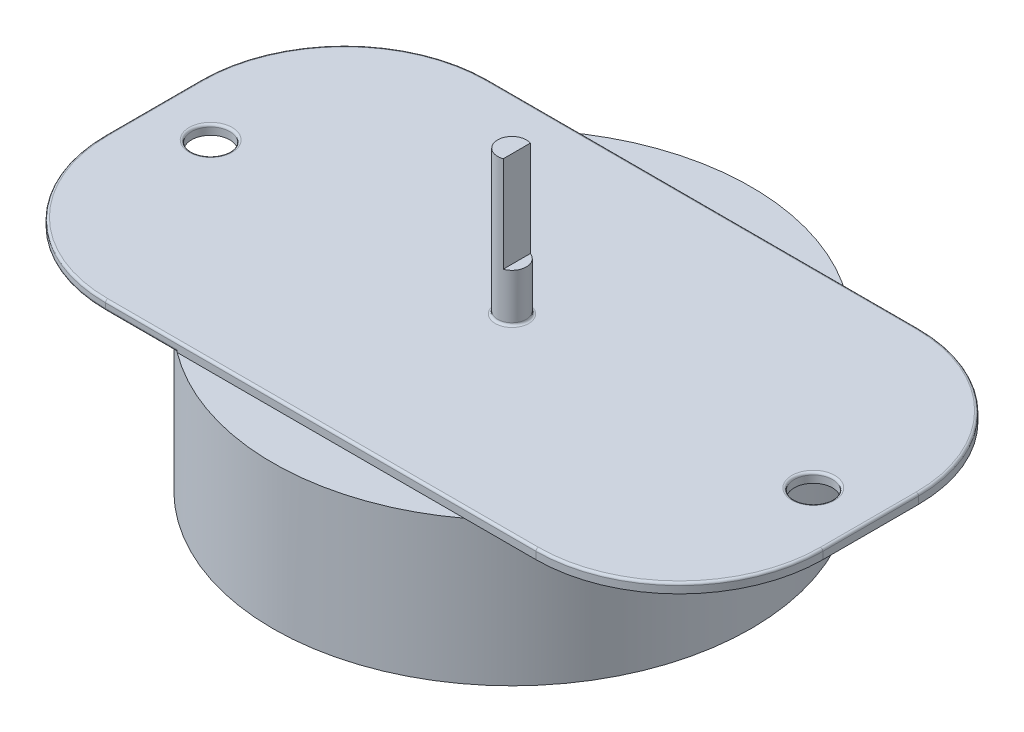
ISO-10303-21;
HEADER;
FILE_DESCRIPTION(('STEP AP214'),'2;1');
FILE_NAME('part.step','',(''),(''),'','','');
FILE_SCHEMA(('AUTOMOTIVE_DESIGN { 1 0 10303 214 1 1 1 1 }'));
ENDSEC;
DATA;
#1=APPLICATION_CONTEXT('core data for automotive mechanical design processes');
#2=APPLICATION_PROTOCOL_DEFINITION('international standard','automotive_design',2000,#1);
#3=PRODUCT_CONTEXT('',#1,'mechanical');
#4=PRODUCT('Part','Part','',(#3));
#5=PRODUCT_RELATED_PRODUCT_CATEGORY('part','',(#4));
#6=PRODUCT_DEFINITION_FORMATION('','',#4);
#7=PRODUCT_DEFINITION_CONTEXT('part definition',#1,'design');
#8=PRODUCT_DEFINITION('design','',#6,#7);
#9=PRODUCT_DEFINITION_SHAPE('','',#8);
#10=(LENGTH_UNIT() NAMED_UNIT(*) SI_UNIT(.MILLI.,.METRE.));
#11=(NAMED_UNIT(*) PLANE_ANGLE_UNIT() SI_UNIT($,.RADIAN.));
#12=(NAMED_UNIT(*) SI_UNIT($,.STERADIAN.) SOLID_ANGLE_UNIT());
#13=UNCERTAINTY_MEASURE_WITH_UNIT(LENGTH_MEASURE(1.E-05),#10,'distance_accuracy_value','');
#14=(GEOMETRIC_REPRESENTATION_CONTEXT(3) GLOBAL_UNCERTAINTY_ASSIGNED_CONTEXT((#13)) GLOBAL_UNIT_ASSIGNED_CONTEXT((#10,
#11,#12)) REPRESENTATION_CONTEXT('',''));
#15=CARTESIAN_POINT('',(0.,0.,0.));
#16=DIRECTION('',(0.,0.,1.));
#17=DIRECTION('',(1.,0.,0.));
#18=AXIS2_PLACEMENT_3D('',#15,#16,#17);
#19=CARTESIAN_POINT('',(0.,30.,0.));
#20=DIRECTION('',(0.,1.,0.));
#21=DIRECTION('',(0.,0.,1.));
#22=AXIS2_PLACEMENT_3D('',#19,#20,#21);
#23=PLANE('',#22);
#24=DIRECTION('',(1.,0.,0.));
#25=VECTOR('',#24,1.);
#26=CARTESIAN_POINT('',(-44.9999999999998,30.,40.));
#27=LINE('',#26,#25);
#28=CARTESIAN_POINT('',(-30.,30.,40.));
#29=VERTEX_POINT('',#28);
#30=CARTESIAN_POINT('',(30.,30.,40.));
#31=VERTEX_POINT('',#30);
#32=EDGE_CURVE('E185',#29,#31,#27,.T.);
#33=ORIENTED_EDGE('',*,*,#32,.F.);
#34=CARTESIAN_POINT('',(0.,30.,0.));
#35=DIRECTION('',(0.,1.,0.));
#36=DIRECTION('',(0.,0.,1.));
#37=AXIS2_PLACEMENT_3D('',#34,#35,#36);
#38=CIRCLE('',#37,50.);
#39=EDGE_CURVE('E240',#29,#31,#38,.T.);
#40=ORIENTED_EDGE('',*,*,#39,.T.);
#41=EDGE_LOOP('',(#33,#40));
#42=FACE_BOUND('',#41,.T.);
#43=ADVANCED_FACE('F33',(#42),#23,.T.);
#44=CARTESIAN_POINT('',(0.,30.,0.));
#45=DIRECTION('',(0.,-1.,0.));
#46=DIRECTION('',(0.,0.,-1.));
#47=AXIS2_PLACEMENT_3D('',#44,#45,#46);
#48=CYLINDRICAL_SURFACE('',#47,50.);
#49=CARTESIAN_POINT('',(30.,30.,-40.));
#50=VERTEX_POINT('',#49);
#51=EDGE_CURVE('E234',#31,#50,#38,.T.);
#52=ORIENTED_EDGE('',*,*,#51,.F.);
#53=ORIENTED_EDGE('',*,*,#39,.F.);
#54=DIRECTION('',(0.,-1.,0.));
#55=VECTOR('',#54,1.);
#56=CARTESIAN_POINT('',(-30.,30.5,40.));
#57=LINE('',#56,#55);
#58=CARTESIAN_POINT('',(-30.,30.5,40.));
#59=VERTEX_POINT('',#58);
#60=EDGE_CURVE('E261',#59,#29,#57,.T.);
#61=ORIENTED_EDGE('',*,*,#60,.F.);
#62=CARTESIAN_POINT('',(-30.,30.5,40.));
#63=CARTESIAN_POINT('',(-29.9999469297059,30.4793692661863,40.0000392803304));
#64=CARTESIAN_POINT('',(-30.0016989201943,30.4588235687539,39.998725841537));
#65=CARTESIAN_POINT('',(-30.0083241019986,30.4187823807294,39.9937559096194));
#66=CARTESIAN_POINT('',(-30.0131589564491,30.3992771360781,39.9901281953354));
#67=CARTESIAN_POINT('',(-30.0254527079931,30.361751862697,39.9808984921336));
#68=CARTESIAN_POINT('',(-30.0328991094319,30.3437252570946,39.9753059044628));
#69=CARTESIAN_POINT('',(-30.0498772600628,30.3092358992607,39.9625448532448));
#70=CARTESIAN_POINT('',(-30.0594157994969,30.2927784955314,39.9553712580058));
#71=CARTESIAN_POINT('',(-30.0858225670734,30.2528492800216,39.9354939882128));
#72=CARTESIAN_POINT('',(-30.1038199785172,30.2305561299036,39.9219312780019));
#73=CARTESIAN_POINT('',(-30.1423057120615,30.1897196783676,39.8928815032563));
#74=CARTESIAN_POINT('',(-30.1627993557367,30.1711846207662,39.8773903259289));
#75=CARTESIAN_POINT('',(-30.2181178759483,30.127401561739,39.8355012064913));
#76=CARTESIAN_POINT('',(-30.254211491877,30.1047259337677,39.8081003104529));
#77=CARTESIAN_POINT('',(-30.3286471596581,30.0664572811339,39.7514197845569));
#78=CARTESIAN_POINT('',(-30.3669961728558,30.0508876407468,39.7221343085376));
#79=CARTESIAN_POINT('',(-30.4469457929851,30.0253723675798,39.660889499431));
#80=CARTESIAN_POINT('',(-30.4886106855827,30.015771410768,39.6288708889413));
#81=CARTESIAN_POINT('',(-30.5512438270458,30.0062671609228,39.5805784559912));
#82=CARTESIAN_POINT('',(-30.5720414537973,30.0039150320054,39.5645166080688));
#83=CARTESIAN_POINT('',(-30.6136756573131,30.000783728554,39.5323102663351));
#84=CARTESIAN_POINT('',(-30.6345122111527,30.0000038146101,39.5161658149555));
#85=CARTESIAN_POINT('',(-30.6553421119387,30.,39.5));
#86=B_SPLINE_CURVE_WITH_KNOTS('',3,(#62,#63,#64,#65,#66,#67,#68,#69,#70,#71,#72,#73,#74,#75,#76,
#77,#78,#79,#80,#81,#82,#83,#84,#85),.UNSPECIFIED.,.F.,.F.,(4,2,2,2,2,2,2,2,2,2,2,4),(0.,
0.0616416621265255,0.122531345672272,0.183133573789917,0.243935482288643,0.338495231506317,
0.433260216403084,0.584439392134947,0.736112541044804,0.89588412437172,0.974994689240367,
1.05406803985992),.UNSPECIFIED.);
#87=CARTESIAN_POINT('',(-30.6553421119387,30.,39.5));
#88=VERTEX_POINT('',#87);
#89=EDGE_CURVE('E11',#59,#88,#86,.T.);
#90=ORIENTED_EDGE('',*,*,#89,.T.);
#91=CARTESIAN_POINT('',(-30.6553421119387,30.,-39.5));
#92=VERTEX_POINT('',#91);
#93=EDGE_CURVE('E238',#92,#88,#38,.T.);
#94=ORIENTED_EDGE('',*,*,#93,.F.);
#95=CARTESIAN_POINT('',(-30.6553421119387,30.,-39.5));
#96=CARTESIAN_POINT('',(-30.6266004798523,30.0000150610145,-39.5223064522361));
#97=CARTESIAN_POINT('',(-30.5978279966109,30.0014937558282,-39.5445855688725));
#98=CARTESIAN_POINT('',(-30.5403569153179,30.0074672286459,-39.5889872408276));
#99=CARTESIAN_POINT('',(-30.5116587058671,30.0119698653224,-39.6111092360467));
#100=CARTESIAN_POINT('',(-30.4542933600515,30.0241510211872,-39.6552309653688));
#101=CARTESIAN_POINT('',(-30.4256304401244,30.0318657498664,-39.6772263096515));
#102=CARTESIAN_POINT('',(-30.3689936390467,30.0506703880144,-39.7205928233665));
#103=CARTESIAN_POINT('',(-30.3410189228909,30.0617559646291,-39.7419647557025));
#104=CARTESIAN_POINT('',(-30.285861090409,30.0877467705342,-39.7840147726815));
#105=CARTESIAN_POINT('',(-30.2586876400879,30.1026862452527,-39.8046846521015));
#106=CARTESIAN_POINT('',(-30.2060754983435,30.1367890212168,-39.8446243131571));
#107=CARTESIAN_POINT('',(-30.1806324735777,30.1559412215375,-39.8638976007227));
#108=CARTESIAN_POINT('',(-30.137915379747,30.1942157323847,-39.8961978737262));
#109=CARTESIAN_POINT('',(-30.1200963851233,30.21236211134,-39.9096508402874));
#110=CARTESIAN_POINT('',(-30.0868519819524,30.251876876341,-39.9347188318157));
#111=CARTESIAN_POINT('',(-30.071423071285,30.2732404559666,-39.946336546427));
#112=CARTESIAN_POINT('',(-30.0481915625417,30.3124102603364,-39.9638127498717));
#113=CARTESIAN_POINT('',(-30.0394876720773,30.3293724303923,-39.9703548977456));
#114=CARTESIAN_POINT('',(-30.0243499643768,30.3647845264933,-39.9817270539512));
#115=CARTESIAN_POINT('',(-30.0179091639889,30.3832296562302,-39.9865623293489));
#116=CARTESIAN_POINT('',(-30.0086961045509,30.417934759082,-39.9934768074905));
#117=CARTESIAN_POINT('',(-30.0054777473321,30.434008132035,-39.995891260257));
#118=CARTESIAN_POINT('',(-30.0011095292461,30.4667072289504,-39.9991678584675));
#119=CARTESIAN_POINT('',(-29.999975326724,30.4833361860595,-40.0000182531173));
#120=CARTESIAN_POINT('',(-30.,30.5,-40.));
#121=B_SPLINE_CURVE_WITH_KNOTS('',3,(#95,#96,#97,#98,#99,#100,#101,#102,#103,#104,#105,#106,
#107,#108,#109,#110,#111,#112,#113,#114,#115,#116,#117,#118,#119,#120),.UNSPECIFIED.,.F.,.F.,(4,
2,2,2,2,2,2,2,2,2,2,2,4),(0.,0.109129044511871,0.218542798601844,0.329224866250502,
0.439765261405262,0.551323940009137,0.662592099617478,0.748656082517678,0.834592740594066,
0.894855060503514,0.954929763112282,1.00443366998699,1.05430800463638),.UNSPECIFIED.);
#122=CARTESIAN_POINT('',(-30.,30.5,-40.));
#123=VERTEX_POINT('',#122);
#124=EDGE_CURVE('E42',#92,#123,#121,.T.);
#125=ORIENTED_EDGE('',*,*,#124,.T.);
#126=DIRECTION('',(0.,-1.,0.));
#127=VECTOR('',#126,1.);
#128=CARTESIAN_POINT('',(-30.,30.,-40.));
#129=LINE('',#128,#127);
#130=CARTESIAN_POINT('',(-30.,30.,-40.));
#131=VERTEX_POINT('',#130);
#132=EDGE_CURVE('E50',#131,#123,#129,.F.);
#133=ORIENTED_EDGE('',*,*,#132,.F.);
#134=EDGE_CURVE('E237',#50,#131,#38,.T.);
#135=ORIENTED_EDGE('',*,*,#134,.F.);
#136=EDGE_LOOP('',(#52,#53,#61,#90,#94,#125,#133,#135));
#137=FACE_BOUND('',#136,.T.);
#138=CARTESIAN_POINT('',(0.,0.,0.));
#139=DIRECTION('',(0.,1.,0.));
#140=DIRECTION('',(0.,0.,1.));
#141=AXIS2_PLACEMENT_3D('',#138,#139,#140);
#142=CIRCLE('',#141,50.);
#143=CARTESIAN_POINT('',(0.,0.,50.));
#144=VERTEX_POINT('',#143);
#145=EDGE_CURVE('E233',#144,#144,#142,.T.);
#146=ORIENTED_EDGE('',*,*,#145,.T.);
#147=EDGE_LOOP('',(#146));
#148=FACE_BOUND('',#147,.T.);
#149=ADVANCED_FACE('F332',(#137,#148),#48,.T.);
#150=DIRECTION('',(-1.,0.,0.));
#151=VECTOR('',#150,1.);
#152=CARTESIAN_POINT('',(-44.9999999999998,30.,-40.));
#153=LINE('',#152,#151);
#154=EDGE_CURVE('E204',#50,#131,#153,.T.);
#155=ORIENTED_EDGE('',*,*,#154,.F.);
#156=ORIENTED_EDGE('',*,*,#134,.T.);
#157=EDGE_LOOP('',(#155,#156));
#158=FACE_BOUND('',#157,.T.);
#159=ADVANCED_FACE('F403',(#158),#23,.T.);
#160=CARTESIAN_POINT('',(0.,0.,0.));
#161=DIRECTION('',(0.,1.,0.));
#162=DIRECTION('',(0.,0.,1.));
#163=AXIS2_PLACEMENT_3D('',#160,#161,#162);
#164=PLANE('',#163);
#165=ORIENTED_EDGE('',*,*,#145,.F.);
#166=EDGE_LOOP('',(#165));
#167=FACE_BOUND('',#166,.T.);
#168=ADVANCED_FACE('F410',(#167),#164,.F.);
#169=CARTESIAN_POINT('',(45.,30.,-10.));
#170=DIRECTION('',(0.,-1.,0.));
#171=DIRECTION('',(0.,0.,-1.));
#172=AXIS2_PLACEMENT_3D('',#169,#170,#171);
#173=PLANE('',#172);
#174=CARTESIAN_POINT('',(63.,30.,0.));
#175=DIRECTION('',(0.,-1.,0.));
#176=DIRECTION('',(0.,0.,-1.));
#177=AXIS2_PLACEMENT_3D('',#174,#175,#176);
#178=CIRCLE('',#177,4.00000000000001);
#179=CARTESIAN_POINT('',(63.,30.,-4.00000000000001));
#180=VERTEX_POINT('',#179);
#181=EDGE_CURVE('E481',#180,#180,#178,.F.);
#182=ORIENTED_EDGE('',*,*,#181,.T.);
#183=EDGE_LOOP('',(#182));
#184=FACE_BOUND('',#183,.T.);
#185=CARTESIAN_POINT('',(44.9999999999998,30.,40.));
#186=VERTEX_POINT('',#185);
#187=EDGE_CURVE('E203',#31,#186,#27,.T.);
#188=ORIENTED_EDGE('',*,*,#187,.F.);
#189=ORIENTED_EDGE('',*,*,#51,.T.);
#190=CARTESIAN_POINT('',(44.9999999999998,30.,-40.));
#191=VERTEX_POINT('',#190);
#192=EDGE_CURVE('E197',#191,#50,#153,.T.);
#193=ORIENTED_EDGE('',*,*,#192,.F.);
#194=CARTESIAN_POINT('',(45.,30.,-10.));
#195=DIRECTION('',(0.,1.,0.));
#196=DIRECTION('',(0.,0.,-1.));
#197=AXIS2_PLACEMENT_3D('',#194,#195,#196);
#198=CIRCLE('',#197,30.);
#199=CARTESIAN_POINT('',(75.,30.,-9.99999999999978));
#200=VERTEX_POINT('',#199);
#201=EDGE_CURVE('E194',#200,#191,#198,.T.);
#202=ORIENTED_EDGE('',*,*,#201,.F.);
#203=DIRECTION('',(0.,0.,-1.));
#204=VECTOR('',#203,1.);
#205=CARTESIAN_POINT('',(75.,30.,9.99999999999979));
#206=LINE('',#205,#204);
#207=CARTESIAN_POINT('',(75.,30.,9.99999999999979));
#208=VERTEX_POINT('',#207);
#209=EDGE_CURVE('E210',#208,#200,#206,.T.);
#210=ORIENTED_EDGE('',*,*,#209,.F.);
#211=CARTESIAN_POINT('',(45.,30.,10.));
#212=DIRECTION('',(0.,1.,0.));
#213=DIRECTION('',(0.,0.,1.));
#214=AXIS2_PLACEMENT_3D('',#211,#212,#213);
#215=CIRCLE('',#214,30.);
#216=EDGE_CURVE('E207',#186,#208,#215,.T.);
#217=ORIENTED_EDGE('',*,*,#216,.F.);
#218=EDGE_LOOP('',(#188,#189,#193,#202,#210,#217));
#219=FACE_BOUND('',#218,.T.);
#220=ADVANCED_FACE('F415',(#184,#219),#173,.T.);
#221=CARTESIAN_POINT('',(45.,32.,-10.));
#222=DIRECTION('',(0.,-1.,0.));
#223=DIRECTION('',(0.,0.,-1.));
#224=AXIS2_PLACEMENT_3D('',#221,#222,#223);
#225=CYLINDRICAL_SURFACE('',#224,30.);
#226=DIRECTION('',(0.,-1.,0.));
#227=VECTOR('',#226,1.);
#228=CARTESIAN_POINT('',(44.9999999999998,32.,-40.));
#229=LINE('',#228,#227);
#230=CARTESIAN_POINT('',(44.9999999999998,31.5,-40.));
#231=VERTEX_POINT('',#230);
#232=EDGE_CURVE('E231',#231,#191,#229,.T.);
#233=ORIENTED_EDGE('',*,*,#232,.F.);
#234=CARTESIAN_POINT('',(45.,31.5,-10.));
#235=DIRECTION('',(0.,-1.,0.));
#236=DIRECTION('',(0.,0.,-1.));
#237=AXIS2_PLACEMENT_3D('',#234,#235,#236);
#238=CIRCLE('',#237,30.);
#239=CARTESIAN_POINT('',(75.,31.5,-9.99999999999978));
#240=VERTEX_POINT('',#239);
#241=EDGE_CURVE('E309',#231,#240,#238,.T.);
#242=ORIENTED_EDGE('',*,*,#241,.T.);
#243=DIRECTION('',(0.,-1.,0.));
#244=VECTOR('',#243,1.);
#245=CARTESIAN_POINT('',(75.,32.,-9.99999999999978));
#246=LINE('',#245,#244);
#247=EDGE_CURVE('E213',#240,#200,#246,.T.);
#248=ORIENTED_EDGE('',*,*,#247,.T.);
#249=ORIENTED_EDGE('',*,*,#201,.T.);
#250=EDGE_LOOP('',(#233,#242,#248,#249));
#251=FACE_BOUND('',#250,.T.);
#252=ADVANCED_FACE('F434',(#251),#225,.T.);
#253=CARTESIAN_POINT('',(-44.9999999999998,32.,-40.));
#254=DIRECTION('',(0.,0.,1.));
#255=DIRECTION('',(1.,0.,0.));
#256=AXIS2_PLACEMENT_3D('',#253,#254,#255);
#257=PLANE('',#256);
#258=ORIENTED_EDGE('',*,*,#132,.T.);
#259=DIRECTION('',(-1.,0.,0.));
#260=VECTOR('',#259,1.);
#261=CARTESIAN_POINT('',(-44.9999999999998,30.5,-40.));
#262=LINE('',#261,#260);
#263=CARTESIAN_POINT('',(-44.9999999999998,30.5,-40.));
#264=VERTEX_POINT('',#263);
#265=EDGE_CURVE('E246',#123,#264,#262,.T.);
#266=ORIENTED_EDGE('',*,*,#265,.T.);
#267=DIRECTION('',(0.,-1.,0.));
#268=VECTOR('',#267,1.);
#269=CARTESIAN_POINT('',(-44.9999999999998,32.,-40.));
#270=LINE('',#269,#268);
#271=CARTESIAN_POINT('',(-44.9999999999998,31.5,-40.));
#272=VERTEX_POINT('',#271);
#273=EDGE_CURVE('E228',#272,#264,#270,.T.);
#274=ORIENTED_EDGE('',*,*,#273,.F.);
#275=DIRECTION('',(-1.,0.,0.));
#276=VECTOR('',#275,1.);
#277=CARTESIAN_POINT('',(-44.9999999999998,31.5,-40.));
#278=LINE('',#277,#276);
#279=EDGE_CURVE('E243',#272,#231,#278,.F.);
#280=ORIENTED_EDGE('',*,*,#279,.T.);
#281=ORIENTED_EDGE('',*,*,#232,.T.);
#282=ORIENTED_EDGE('',*,*,#192,.T.);
#283=ORIENTED_EDGE('',*,*,#154,.T.);
#284=EDGE_LOOP('',(#258,#266,#274,#280,#281,#282,#283));
#285=FACE_BOUND('',#284,.T.);
#286=ADVANCED_FACE('F428',(#285),#257,.F.);
#287=CARTESIAN_POINT('',(-45.,32.,-10.));
#288=DIRECTION('',(0.,-1.,0.));
#289=DIRECTION('',(0.,0.,-1.));
#290=AXIS2_PLACEMENT_3D('',#287,#288,#289);
#291=CYLINDRICAL_SURFACE('',#290,30.);
#292=DIRECTION('',(0.,-1.,0.));
#293=VECTOR('',#292,1.);
#294=CARTESIAN_POINT('',(-75.,32.,-9.99999999999978));
#295=LINE('',#294,#293);
#296=CARTESIAN_POINT('',(-75.,31.5,-9.99999999999978));
#297=VERTEX_POINT('',#296);
#298=CARTESIAN_POINT('',(-75.,30.5,-9.99999999999978));
#299=VERTEX_POINT('',#298);
#300=EDGE_CURVE('E225',#297,#299,#295,.T.);
#301=ORIENTED_EDGE('',*,*,#300,.F.);
#302=CARTESIAN_POINT('',(-45.,31.5,-10.));
#303=DIRECTION('',(0.,-1.,0.));
#304=DIRECTION('',(0.,0.,-1.));
#305=AXIS2_PLACEMENT_3D('',#302,#303,#304);
#306=CIRCLE('',#305,30.);
#307=EDGE_CURVE('E307',#297,#272,#306,.T.);
#308=ORIENTED_EDGE('',*,*,#307,.T.);
#309=ORIENTED_EDGE('',*,*,#273,.T.);
#310=CARTESIAN_POINT('',(-45.,30.5,-10.));
#311=DIRECTION('',(0.,-1.,0.));
#312=DIRECTION('',(0.,0.,-1.));
#313=AXIS2_PLACEMENT_3D('',#310,#311,#312);
#314=CIRCLE('',#313,30.);
#315=EDGE_CURVE('E305',#264,#299,#314,.F.);
#316=ORIENTED_EDGE('',*,*,#315,.T.);
#317=EDGE_LOOP('',(#301,#308,#309,#316));
#318=FACE_BOUND('',#317,.T.);
#319=ADVANCED_FACE('F537',(#318),#291,.T.);
#320=CARTESIAN_POINT('',(-75.,32.,9.99999999999979));
#321=DIRECTION('',(1.,0.,0.));
#322=DIRECTION('',(0.,0.,-1.));
#323=AXIS2_PLACEMENT_3D('',#320,#321,#322);
#324=PLANE('',#323);
#325=ORIENTED_EDGE('',*,*,#300,.T.);
#326=DIRECTION('',(0.,0.,1.));
#327=VECTOR('',#326,1.);
#328=CARTESIAN_POINT('',(-75.,30.5,9.99999999999979));
#329=LINE('',#328,#327);
#330=CARTESIAN_POINT('',(-75.,30.5,9.99999999999979));
#331=VERTEX_POINT('',#330);
#332=EDGE_CURVE('E272',#299,#331,#329,.T.);
#333=ORIENTED_EDGE('',*,*,#332,.T.);
#334=DIRECTION('',(0.,-1.,0.));
#335=VECTOR('',#334,1.);
#336=CARTESIAN_POINT('',(-75.,32.,9.99999999999979));
#337=LINE('',#336,#335);
#338=CARTESIAN_POINT('',(-75.,31.5,9.99999999999979));
#339=VERTEX_POINT('',#338);
#340=EDGE_CURVE('E222',#339,#331,#337,.T.);
#341=ORIENTED_EDGE('',*,*,#340,.F.);
#342=DIRECTION('',(0.,0.,1.));
#343=VECTOR('',#342,1.);
#344=CARTESIAN_POINT('',(-75.,31.5,9.99999999999979));
#345=LINE('',#344,#343);
#346=EDGE_CURVE('E270',#339,#297,#345,.F.);
#347=ORIENTED_EDGE('',*,*,#346,.T.);
#348=EDGE_LOOP('',(#325,#333,#341,#347));
#349=FACE_BOUND('',#348,.T.);
#350=ADVANCED_FACE('F533',(#349),#324,.F.);
#351=CARTESIAN_POINT('',(-45.,32.,10.));
#352=DIRECTION('',(0.,-1.,0.));
#353=DIRECTION('',(0.,0.,-1.));
#354=AXIS2_PLACEMENT_3D('',#351,#352,#353);
#355=CYLINDRICAL_SURFACE('',#354,30.);
#356=ORIENTED_EDGE('',*,*,#340,.T.);
#357=CARTESIAN_POINT('',(-45.,30.5,10.));
#358=DIRECTION('',(0.,-1.,0.));
#359=DIRECTION('',(0.,0.,-1.));
#360=AXIS2_PLACEMENT_3D('',#357,#358,#359);
#361=CIRCLE('',#360,30.);
#362=CARTESIAN_POINT('',(-44.9999999999998,30.5,40.));
#363=VERTEX_POINT('',#362);
#364=EDGE_CURVE('E268',#331,#363,#361,.F.);
#365=ORIENTED_EDGE('',*,*,#364,.T.);
#366=DIRECTION('',(0.,-1.,0.));
#367=VECTOR('',#366,1.);
#368=CARTESIAN_POINT('',(-44.9999999999998,32.,40.));
#369=LINE('',#368,#367);
#370=CARTESIAN_POINT('',(-44.9999999999998,31.5,40.));
#371=VERTEX_POINT('',#370);
#372=EDGE_CURVE('E219',#371,#363,#369,.T.);
#373=ORIENTED_EDGE('',*,*,#372,.F.);
#374=CARTESIAN_POINT('',(-45.,31.5,10.));
#375=DIRECTION('',(0.,-1.,0.));
#376=DIRECTION('',(0.,0.,-1.));
#377=AXIS2_PLACEMENT_3D('',#374,#375,#376);
#378=CIRCLE('',#377,30.);
#379=EDGE_CURVE('E266',#371,#339,#378,.T.);
#380=ORIENTED_EDGE('',*,*,#379,.T.);
#381=EDGE_LOOP('',(#356,#365,#373,#380));
#382=FACE_BOUND('',#381,.T.);
#383=ADVANCED_FACE('F529',(#382),#355,.T.);
#384=CARTESIAN_POINT('',(-44.9999999999998,32.,40.));
#385=DIRECTION('',(0.,0.,-1.));
#386=DIRECTION('',(-1.,0.,0.));
#387=AXIS2_PLACEMENT_3D('',#384,#385,#386);
#388=PLANE('',#387);
#389=ORIENTED_EDGE('',*,*,#372,.T.);
#390=DIRECTION('',(1.,0.,0.));
#391=VECTOR('',#390,1.);
#392=CARTESIAN_POINT('',(-30.,30.5,40.));
#393=LINE('',#392,#391);
#394=EDGE_CURVE('E263',#363,#59,#393,.T.);
#395=ORIENTED_EDGE('',*,*,#394,.T.);
#396=ORIENTED_EDGE('',*,*,#60,.T.);
#397=ORIENTED_EDGE('',*,*,#32,.T.);
#398=ORIENTED_EDGE('',*,*,#187,.T.);
#399=DIRECTION('',(0.,-1.,0.));
#400=VECTOR('',#399,1.);
#401=CARTESIAN_POINT('',(44.9999999999998,32.,40.));
#402=LINE('',#401,#400);
#403=CARTESIAN_POINT('',(44.9999999999998,31.5,40.));
#404=VERTEX_POINT('',#403);
#405=EDGE_CURVE('E217',#404,#186,#402,.T.);
#406=ORIENTED_EDGE('',*,*,#405,.F.);
#407=DIRECTION('',(1.,0.,0.));
#408=VECTOR('',#407,1.);
#409=CARTESIAN_POINT('',(-44.9999999999998,31.5,40.));
#410=LINE('',#409,#408);
#411=EDGE_CURVE('E259',#404,#371,#410,.F.);
#412=ORIENTED_EDGE('',*,*,#411,.T.);
#413=EDGE_LOOP('',(#389,#395,#396,#397,#398,#406,#412));
#414=FACE_BOUND('',#413,.T.);
#415=ADVANCED_FACE('F525',(#414),#388,.F.);
#416=CARTESIAN_POINT('',(45.,32.,10.));
#417=DIRECTION('',(0.,-1.,0.));
#418=DIRECTION('',(0.,0.,-1.));
#419=AXIS2_PLACEMENT_3D('',#416,#417,#418);
#420=CYLINDRICAL_SURFACE('',#419,30.);
#421=DIRECTION('',(0.,-1.,0.));
#422=VECTOR('',#421,1.);
#423=CARTESIAN_POINT('',(75.,32.,9.99999999999979));
#424=LINE('',#423,#422);
#425=CARTESIAN_POINT('',(75.,31.5,9.99999999999979));
#426=VERTEX_POINT('',#425);
#427=EDGE_CURVE('E215',#426,#208,#424,.T.);
#428=ORIENTED_EDGE('',*,*,#427,.F.);
#429=CARTESIAN_POINT('',(45.,31.5,10.));
#430=DIRECTION('',(0.,-1.,0.));
#431=DIRECTION('',(0.,0.,-1.));
#432=AXIS2_PLACEMENT_3D('',#429,#430,#431);
#433=CIRCLE('',#432,30.);
#434=EDGE_CURVE('E303',#426,#404,#433,.T.);
#435=ORIENTED_EDGE('',*,*,#434,.T.);
#436=ORIENTED_EDGE('',*,*,#405,.T.);
#437=ORIENTED_EDGE('',*,*,#216,.T.);
#438=EDGE_LOOP('',(#428,#435,#436,#437));
#439=FACE_BOUND('',#438,.T.);
#440=ADVANCED_FACE('F521',(#439),#420,.T.);
#441=CARTESIAN_POINT('',(75.,32.,9.99999999999979));
#442=DIRECTION('',(-1.,0.,0.));
#443=DIRECTION('',(0.,0.,1.));
#444=AXIS2_PLACEMENT_3D('',#441,#442,#443);
#445=PLANE('',#444);
#446=ORIENTED_EDGE('',*,*,#247,.F.);
#447=DIRECTION('',(0.,0.,-1.));
#448=VECTOR('',#447,1.);
#449=CARTESIAN_POINT('',(75.,31.5,9.99999999999979));
#450=LINE('',#449,#448);
#451=EDGE_CURVE('E300',#240,#426,#450,.F.);
#452=ORIENTED_EDGE('',*,*,#451,.T.);
#453=ORIENTED_EDGE('',*,*,#427,.T.);
#454=ORIENTED_EDGE('',*,*,#209,.T.);
#455=EDGE_LOOP('',(#446,#452,#453,#454));
#456=FACE_BOUND('',#455,.T.);
#457=ADVANCED_FACE('F514',(#456),#445,.F.);
#458=CARTESIAN_POINT('',(45.,32.,-10.));
#459=DIRECTION('',(0.,-1.,0.));
#460=DIRECTION('',(0.,0.,-1.));
#461=AXIS2_PLACEMENT_3D('',#458,#459,#460);
#462=PLANE('',#461);
#463=CARTESIAN_POINT('',(45.,32.,10.));
#464=DIRECTION('',(0.,-1.,0.));
#465=DIRECTION('',(0.,0.,-1.));
#466=AXIS2_PLACEMENT_3D('',#463,#464,#465);
#467=CIRCLE('',#466,29.5);
#468=CARTESIAN_POINT('',(44.9999999999998,32.,39.5));
#469=VERTEX_POINT('',#468);
#470=CARTESIAN_POINT('',(74.5,32.,9.99999999999979));
#471=VERTEX_POINT('',#470);
#472=EDGE_CURVE('E295',#469,#471,#467,.F.);
#473=ORIENTED_EDGE('',*,*,#472,.T.);
#474=DIRECTION('',(0.,0.,-1.));
#475=VECTOR('',#474,1.);
#476=CARTESIAN_POINT('',(74.5,32.,-10.));
#477=LINE('',#476,#475);
#478=CARTESIAN_POINT('',(74.5,32.,-9.99999999999978));
#479=VERTEX_POINT('',#478);
#480=EDGE_CURVE('E297',#471,#479,#477,.T.);
#481=ORIENTED_EDGE('',*,*,#480,.T.);
#482=CARTESIAN_POINT('',(45.,32.,-10.));
#483=DIRECTION('',(0.,-1.,0.));
#484=DIRECTION('',(0.,0.,-1.));
#485=AXIS2_PLACEMENT_3D('',#482,#483,#484);
#486=CIRCLE('',#485,29.5);
#487=CARTESIAN_POINT('',(44.9999999999998,32.,-39.5));
#488=VERTEX_POINT('',#487);
#489=EDGE_CURVE('E283',#479,#488,#486,.F.);
#490=ORIENTED_EDGE('',*,*,#489,.T.);
#491=DIRECTION('',(-1.,0.,0.));
#492=VECTOR('',#491,1.);
#493=CARTESIAN_POINT('',(45.,32.,-39.5));
#494=LINE('',#493,#492);
#495=CARTESIAN_POINT('',(-44.9999999999998,32.,-39.5));
#496=VERTEX_POINT('',#495);
#497=EDGE_CURVE('E285',#488,#496,#494,.T.);
#498=ORIENTED_EDGE('',*,*,#497,.T.);
#499=CARTESIAN_POINT('',(-45.,32.,-10.));
#500=DIRECTION('',(0.,-1.,0.));
#501=DIRECTION('',(0.,0.,-1.));
#502=AXIS2_PLACEMENT_3D('',#499,#500,#501);
#503=CIRCLE('',#502,29.5);
#504=CARTESIAN_POINT('',(-74.5,32.,-9.99999999999978));
#505=VERTEX_POINT('',#504);
#506=EDGE_CURVE('E287',#496,#505,#503,.F.);
#507=ORIENTED_EDGE('',*,*,#506,.T.);
#508=DIRECTION('',(0.,0.,1.));
#509=VECTOR('',#508,1.);
#510=CARTESIAN_POINT('',(-74.5,32.,-10.));
#511=LINE('',#510,#509);
#512=CARTESIAN_POINT('',(-74.5,32.,9.99999999999979));
#513=VERTEX_POINT('',#512);
#514=EDGE_CURVE('E289',#505,#513,#511,.T.);
#515=ORIENTED_EDGE('',*,*,#514,.T.);
#516=CARTESIAN_POINT('',(-45.,32.,10.));
#517=DIRECTION('',(0.,-1.,0.));
#518=DIRECTION('',(0.,0.,-1.));
#519=AXIS2_PLACEMENT_3D('',#516,#517,#518);
#520=CIRCLE('',#519,29.5);
#521=CARTESIAN_POINT('',(-44.9999999999998,32.,39.5));
#522=VERTEX_POINT('',#521);
#523=EDGE_CURVE('E291',#513,#522,#520,.F.);
#524=ORIENTED_EDGE('',*,*,#523,.T.);
#525=DIRECTION('',(1.,0.,0.));
#526=VECTOR('',#525,1.);
#527=CARTESIAN_POINT('',(45.,32.,39.5));
#528=LINE('',#527,#526);
#529=EDGE_CURVE('E293',#522,#469,#528,.T.);
#530=ORIENTED_EDGE('',*,*,#529,.T.);
#531=EDGE_LOOP('',(#473,#481,#490,#498,#507,#515,#524,#530));
#532=FACE_BOUND('',#531,.T.);
#533=CARTESIAN_POINT('',(0.,32.,0.));
#534=DIRECTION('',(0.,-1.,0.));
#535=DIRECTION('',(0.,0.,-1.));
#536=AXIS2_PLACEMENT_3D('',#533,#534,#535);
#537=CIRCLE('',#536,3.5);
#538=CARTESIAN_POINT('',(0.,32.,-3.5));
#539=VERTEX_POINT('',#538);
#540=EDGE_CURVE('E280',#539,#539,#537,.T.);
#541=ORIENTED_EDGE('',*,*,#540,.T.);
#542=EDGE_LOOP('',(#541));
#543=FACE_BOUND('',#542,.T.);
#544=CARTESIAN_POINT('',(63.,32.,0.));
#545=DIRECTION('',(0.,-1.,0.));
#546=DIRECTION('',(0.,0.,-1.));
#547=AXIS2_PLACEMENT_3D('',#544,#545,#546);
#548=CIRCLE('',#547,4.50000000000001);
#549=CARTESIAN_POINT('',(63.,32.,-4.50000000000001));
#550=VERTEX_POINT('',#549);
#551=EDGE_CURVE('E277',#550,#550,#548,.T.);
#552=ORIENTED_EDGE('',*,*,#551,.T.);
#553=EDGE_LOOP('',(#552));
#554=FACE_BOUND('',#553,.T.);
#555=CARTESIAN_POINT('',(-63.,32.,0.));
#556=DIRECTION('',(0.,-1.,0.));
#557=DIRECTION('',(0.,0.,-1.));
#558=AXIS2_PLACEMENT_3D('',#555,#556,#557);
#559=CIRCLE('',#558,4.50000000000001);
#560=CARTESIAN_POINT('',(-63.,32.,-4.50000000000001));
#561=VERTEX_POINT('',#560);
#562=EDGE_CURVE('E274',#561,#561,#559,.T.);
#563=ORIENTED_EDGE('',*,*,#562,.T.);
#564=EDGE_LOOP('',(#563));
#565=FACE_BOUND('',#564,.T.);
#566=ADVANCED_FACE('F511',(#532,#543,#554,#565),#462,.F.);
#567=CARTESIAN_POINT('',(-63.,30.,0.));
#568=DIRECTION('',(0.,-1.,0.));
#569=DIRECTION('',(0.,0.,-1.));
#570=AXIS2_PLACEMENT_3D('',#567,#568,#569);
#571=CIRCLE('',#570,4.00000000000001);
#572=CARTESIAN_POINT('',(-63.,30.,-4.00000000000001));
#573=VERTEX_POINT('',#572);
#574=EDGE_CURVE('E486',#573,#573,#571,.F.);
#575=ORIENTED_EDGE('',*,*,#574,.T.);
#576=EDGE_LOOP('',(#575));
#577=FACE_BOUND('',#576,.T.);
#578=CARTESIAN_POINT('',(-45.,30.,-10.));
#579=DIRECTION('',(0.,-1.,0.));
#580=DIRECTION('',(0.,0.,-1.));
#581=AXIS2_PLACEMENT_3D('',#578,#579,#580);
#582=CIRCLE('',#581,29.5);
#583=CARTESIAN_POINT('',(-74.5,30.,-9.99999999999978));
#584=VERTEX_POINT('',#583);
#585=CARTESIAN_POINT('',(-44.9999999999998,30.,-39.5));
#586=VERTEX_POINT('',#585);
#587=EDGE_CURVE('E249',#584,#586,#582,.T.);
#588=ORIENTED_EDGE('',*,*,#587,.T.);
#589=DIRECTION('',(-1.,0.,0.));
#590=VECTOR('',#589,1.);
#591=CARTESIAN_POINT('',(-30.,30.,-39.5));
#592=LINE('',#591,#590);
#593=EDGE_CURVE('E257',#586,#92,#592,.F.);
#594=ORIENTED_EDGE('',*,*,#593,.T.);
#595=ORIENTED_EDGE('',*,*,#93,.T.);
#596=DIRECTION('',(1.,0.,0.));
#597=VECTOR('',#596,1.);
#598=CARTESIAN_POINT('',(-44.9999999999998,30.,39.5));
#599=LINE('',#598,#597);
#600=CARTESIAN_POINT('',(-44.9999999999998,30.,39.5));
#601=VERTEX_POINT('',#600);
#602=EDGE_CURVE('E255',#88,#601,#599,.F.);
#603=ORIENTED_EDGE('',*,*,#602,.T.);
#604=CARTESIAN_POINT('',(-45.,30.,10.));
#605=DIRECTION('',(0.,-1.,0.));
#606=DIRECTION('',(0.,0.,-1.));
#607=AXIS2_PLACEMENT_3D('',#604,#605,#606);
#608=CIRCLE('',#607,29.5);
#609=CARTESIAN_POINT('',(-74.5,30.,9.99999999999979));
#610=VERTEX_POINT('',#609);
#611=EDGE_CURVE('E253',#601,#610,#608,.T.);
#612=ORIENTED_EDGE('',*,*,#611,.T.);
#613=DIRECTION('',(0.,0.,1.));
#614=VECTOR('',#613,1.);
#615=CARTESIAN_POINT('',(-74.5,30.,-9.99999999999978));
#616=LINE('',#615,#614);
#617=EDGE_CURVE('E251',#610,#584,#616,.F.);
#618=ORIENTED_EDGE('',*,*,#617,.T.);
#619=EDGE_LOOP('',(#588,#594,#595,#603,#612,#618));
#620=FACE_BOUND('',#619,.T.);
#621=ADVANCED_FACE('F509',(#577,#620),#173,.T.);
#622=CARTESIAN_POINT('',(0.,62.,0.));
#623=DIRECTION('',(0.,-1.,0.));
#624=DIRECTION('',(0.,0.,-1.));
#625=AXIS2_PLACEMENT_3D('',#622,#623,#624);
#626=CYLINDRICAL_SURFACE('',#625,3.);
#627=CARTESIAN_POINT('',(0.,32.5,0.));
#628=DIRECTION('',(0.,-1.,0.));
#629=DIRECTION('',(0.,0.,-1.));
#630=AXIS2_PLACEMENT_3D('',#627,#628,#629);
#631=CIRCLE('',#630,3.);
#632=CARTESIAN_POINT('',(0.,32.5,-3.));
#633=VERTEX_POINT('',#632);
#634=EDGE_CURVE('E311',#633,#633,#631,.F.);
#635=ORIENTED_EDGE('',*,*,#634,.T.);
#636=EDGE_LOOP('',(#635));
#637=FACE_BOUND('',#636,.T.);
#638=CARTESIAN_POINT('',(0.,62.,0.));
#639=DIRECTION('',(0.,1.,0.));
#640=DIRECTION('',(0.,0.,1.));
#641=AXIS2_PLACEMENT_3D('',#638,#639,#640);
#642=CIRCLE('',#641,3.);
#643=CARTESIAN_POINT('',(1.,62.,-2.82842712474619));
#644=VERTEX_POINT('',#643);
#645=CARTESIAN_POINT('',(1.,62.,2.82842712474619));
#646=VERTEX_POINT('',#645);
#647=EDGE_CURVE('E190',#644,#646,#642,.T.);
#648=ORIENTED_EDGE('',*,*,#647,.F.);
#649=DIRECTION('',(0.,-1.,0.));
#650=VECTOR('',#649,1.);
#651=CARTESIAN_POINT('',(1.,62.,-2.82842712474619));
#652=LINE('',#651,#650);
#653=CARTESIAN_POINT('',(1.,42.,-2.82842712474619));
#654=VERTEX_POINT('',#653);
#655=EDGE_CURVE('E180',#644,#654,#652,.T.);
#656=ORIENTED_EDGE('',*,*,#655,.T.);
#657=CARTESIAN_POINT('',(0.,42.,0.));
#658=DIRECTION('',(0.,-1.,0.));
#659=DIRECTION('',(0.,0.,-1.));
#660=AXIS2_PLACEMENT_3D('',#657,#658,#659);
#661=CIRCLE('',#660,3.);
#662=CARTESIAN_POINT('',(1.,42.,2.82842712474619));
#663=VERTEX_POINT('',#662);
#664=EDGE_CURVE('E184',#654,#663,#661,.T.);
#665=ORIENTED_EDGE('',*,*,#664,.T.);
#666=DIRECTION('',(0.,-1.,0.));
#667=VECTOR('',#666,1.);
#668=CARTESIAN_POINT('',(1.,62.,2.82842712474619));
#669=LINE('',#668,#667);
#670=EDGE_CURVE('E177',#663,#646,#669,.F.);
#671=ORIENTED_EDGE('',*,*,#670,.T.);
#672=EDGE_LOOP('',(#648,#656,#665,#671));
#673=FACE_BOUND('',#672,.T.);
#674=ADVANCED_FACE('F189',(#637,#673),#626,.T.);
#675=CARTESIAN_POINT('',(0.,62.,0.));
#676=DIRECTION('',(0.,1.,0.));
#677=DIRECTION('',(0.,0.,1.));
#678=AXIS2_PLACEMENT_3D('',#675,#676,#677);
#679=PLANE('',#678);
#680=DIRECTION('',(0.,0.,1.));
#681=VECTOR('',#680,1.);
#682=CARTESIAN_POINT('',(1.,62.,0.));
#683=LINE('',#682,#681);
#684=EDGE_CURVE('E173',#644,#646,#683,.T.);
#685=ORIENTED_EDGE('',*,*,#684,.F.);
#686=ORIENTED_EDGE('',*,*,#647,.T.);
#687=EDGE_LOOP('',(#685,#686));
#688=FACE_BOUND('',#687,.T.);
#689=ADVANCED_FACE('F193',(#688),#679,.T.);
#690=CARTESIAN_POINT('',(0.,42.,0.));
#691=DIRECTION('',(0.,-1.,0.));
#692=DIRECTION('',(0.,0.,-1.));
#693=AXIS2_PLACEMENT_3D('',#690,#691,#692);
#694=PLANE('',#693);
#695=DIRECTION('',(0.,0.,1.));
#696=VECTOR('',#695,1.);
#697=CARTESIAN_POINT('',(1.,42.,3.3933713107956));
#698=LINE('',#697,#696);
#699=EDGE_CURVE('E191',#654,#663,#698,.T.);
#700=ORIENTED_EDGE('',*,*,#699,.T.);
#701=ORIENTED_EDGE('',*,*,#664,.F.);
#702=EDGE_LOOP('',(#700,#701));
#703=FACE_BOUND('',#702,.T.);
#704=ADVANCED_FACE('F494',(#703),#694,.F.);
#705=CARTESIAN_POINT('',(1.,42.,3.3933713107956));
#706=DIRECTION('',(-1.,0.,0.));
#707=DIRECTION('',(0.,0.,1.));
#708=AXIS2_PLACEMENT_3D('',#705,#706,#707);
#709=PLANE('',#708);
#710=ORIENTED_EDGE('',*,*,#684,.T.);
#711=ORIENTED_EDGE('',*,*,#670,.F.);
#712=ORIENTED_EDGE('',*,*,#699,.F.);
#713=ORIENTED_EDGE('',*,*,#655,.F.);
#714=EDGE_LOOP('',(#710,#711,#712,#713));
#715=FACE_BOUND('',#714,.T.);
#716=ADVANCED_FACE('F175',(#715),#709,.F.);
#717=CARTESIAN_POINT('',(-63.,-0.001000000000001,0.));
#718=DIRECTION('',(0.,1.,0.));
#719=DIRECTION('',(0.,0.,1.));
#720=AXIS2_PLACEMENT_3D('',#717,#718,#719);
#721=CYLINDRICAL_SURFACE('',#720,4.00000000000001);
#722=CARTESIAN_POINT('',(-63.,31.5,0.));
#723=DIRECTION('',(0.,-1.,0.));
#724=DIRECTION('',(0.,0.,-1.));
#725=AXIS2_PLACEMENT_3D('',#722,#723,#724);
#726=CIRCLE('',#725,4.00000000000001);
#727=CARTESIAN_POINT('',(-63.,31.5,-4.00000000000001));
#728=VERTEX_POINT('',#727);
#729=EDGE_CURVE('E317',#728,#728,#726,.F.);
#730=ORIENTED_EDGE('',*,*,#729,.T.);
#731=EDGE_LOOP('',(#730));
#732=FACE_BOUND('',#731,.T.);
#733=ORIENTED_EDGE('',*,*,#574,.F.);
#734=EDGE_LOOP('',(#733));
#735=FACE_BOUND('',#734,.T.);
#736=ADVANCED_FACE('F501',(#732,#735),#721,.F.);
#737=CARTESIAN_POINT('',(63.,-0.001000000000001,0.));
#738=DIRECTION('',(0.,1.,0.));
#739=DIRECTION('',(0.,0.,1.));
#740=AXIS2_PLACEMENT_3D('',#737,#738,#739);
#741=CYLINDRICAL_SURFACE('',#740,4.00000000000001);
#742=CARTESIAN_POINT('',(63.,31.5,0.));
#743=DIRECTION('',(0.,-1.,0.));
#744=DIRECTION('',(0.,0.,-1.));
#745=AXIS2_PLACEMENT_3D('',#742,#743,#744);
#746=CIRCLE('',#745,4.00000000000001);
#747=CARTESIAN_POINT('',(63.,31.5,-4.00000000000001));
#748=VERTEX_POINT('',#747);
#749=EDGE_CURVE('E314',#748,#748,#746,.F.);
#750=ORIENTED_EDGE('',*,*,#749,.T.);
#751=EDGE_LOOP('',(#750));
#752=FACE_BOUND('',#751,.T.);
#753=ORIENTED_EDGE('',*,*,#181,.F.);
#754=EDGE_LOOP('',(#753));
#755=FACE_BOUND('',#754,.T.);
#756=ADVANCED_FACE('F356',(#752,#755),#741,.F.);
#757=CARTESIAN_POINT('',(-44.9999999999998,30.5,39.5));
#758=DIRECTION('',(-1.,0.,0.));
#759=DIRECTION('',(0.,0.,1.));
#760=AXIS2_PLACEMENT_3D('',#757,#758,#759);
#761=CYLINDRICAL_SURFACE('',#760,0.5);
#762=ORIENTED_EDGE('',*,*,#89,.F.);
#763=ORIENTED_EDGE('',*,*,#394,.F.);
#764=CARTESIAN_POINT('',(-44.9999999999998,30.5,39.5));
#765=DIRECTION('',(-1.,0.,0.));
#766=DIRECTION('',(0.,0.,1.));
#767=AXIS2_PLACEMENT_3D('',#764,#765,#766);
#768=CIRCLE('',#767,0.5);
#769=EDGE_CURVE('E449',#601,#363,#768,.T.);
#770=ORIENTED_EDGE('',*,*,#769,.F.);
#771=ORIENTED_EDGE('',*,*,#602,.F.);
#772=EDGE_LOOP('',(#762,#763,#770,#771));
#773=FACE_BOUND('',#772,.T.);
#774=ADVANCED_FACE('F351',(#773),#761,.T.);
#775=CARTESIAN_POINT('',(-45.,30.5,10.));
#776=DIRECTION('',(0.,-1.,0.));
#777=DIRECTION('',(0.,0.,-1.));
#778=AXIS2_PLACEMENT_3D('',#775,#776,#777);
#779=TOROIDAL_SURFACE('',#778,29.5,0.5);
#780=ORIENTED_EDGE('',*,*,#769,.T.);
#781=ORIENTED_EDGE('',*,*,#364,.F.);
#782=CARTESIAN_POINT('',(-74.5,30.5,9.99999999999979));
#783=DIRECTION('',(0.,0.,-1.));
#784=DIRECTION('',(-1.,0.,0.));
#785=AXIS2_PLACEMENT_3D('',#782,#783,#784);
#786=CIRCLE('',#785,0.5);
#787=EDGE_CURVE('E474',#610,#331,#786,.T.);
#788=ORIENTED_EDGE('',*,*,#787,.F.);
#789=ORIENTED_EDGE('',*,*,#611,.F.);
#790=EDGE_LOOP('',(#780,#781,#788,#789));
#791=FACE_BOUND('',#790,.T.);
#792=ADVANCED_FACE('F348',(#791),#779,.T.);
#793=CARTESIAN_POINT('',(-74.5,30.5,9.99999999999979));
#794=DIRECTION('',(0.,0.,-1.));
#795=DIRECTION('',(-1.,0.,0.));
#796=AXIS2_PLACEMENT_3D('',#793,#794,#795);
#797=CYLINDRICAL_SURFACE('',#796,0.5);
#798=ORIENTED_EDGE('',*,*,#787,.T.);
#799=ORIENTED_EDGE('',*,*,#332,.F.);
#800=CARTESIAN_POINT('',(-74.5,30.5,-9.99999999999978));
#801=DIRECTION('',(0.,0.,-1.));
#802=DIRECTION('',(-1.,0.,0.));
#803=AXIS2_PLACEMENT_3D('',#800,#801,#802);
#804=CIRCLE('',#803,0.5);
#805=EDGE_CURVE('E468',#584,#299,#804,.T.);
#806=ORIENTED_EDGE('',*,*,#805,.F.);
#807=ORIENTED_EDGE('',*,*,#617,.F.);
#808=EDGE_LOOP('',(#798,#799,#806,#807));
#809=FACE_BOUND('',#808,.T.);
#810=ADVANCED_FACE('F344',(#809),#797,.T.);
#811=CARTESIAN_POINT('',(-45.,30.5,-10.));
#812=DIRECTION('',(0.,-1.,0.));
#813=DIRECTION('',(0.,0.,-1.));
#814=AXIS2_PLACEMENT_3D('',#811,#812,#813);
#815=TOROIDAL_SURFACE('',#814,29.5,0.5);
#816=ORIENTED_EDGE('',*,*,#805,.T.);
#817=ORIENTED_EDGE('',*,*,#315,.F.);
#818=CARTESIAN_POINT('',(-44.9999999999998,30.5,-39.5));
#819=DIRECTION('',(1.,0.,0.));
#820=DIRECTION('',(0.,0.,-1.));
#821=AXIS2_PLACEMENT_3D('',#818,#819,#820);
#822=CIRCLE('',#821,0.5);
#823=EDGE_CURVE('E464',#586,#264,#822,.T.);
#824=ORIENTED_EDGE('',*,*,#823,.F.);
#825=ORIENTED_EDGE('',*,*,#587,.F.);
#826=EDGE_LOOP('',(#816,#817,#824,#825));
#827=FACE_BOUND('',#826,.T.);
#828=ADVANCED_FACE('F340',(#827),#815,.T.);
#829=CARTESIAN_POINT('',(-44.9999999999998,30.5,-39.5));
#830=DIRECTION('',(1.,0.,0.));
#831=DIRECTION('',(0.,0.,-1.));
#832=AXIS2_PLACEMENT_3D('',#829,#830,#831);
#833=CYLINDRICAL_SURFACE('',#832,0.5);
#834=ORIENTED_EDGE('',*,*,#124,.F.);
#835=ORIENTED_EDGE('',*,*,#593,.F.);
#836=ORIENTED_EDGE('',*,*,#823,.T.);
#837=ORIENTED_EDGE('',*,*,#265,.F.);
#838=EDGE_LOOP('',(#834,#835,#836,#837));
#839=FACE_BOUND('',#838,.T.);
#840=ADVANCED_FACE('F335',(#839),#833,.T.);
#841=CARTESIAN_POINT('',(-74.5,31.5,-10.));
#842=DIRECTION('',(0.,0.,1.));
#843=DIRECTION('',(1.,0.,0.));
#844=AXIS2_PLACEMENT_3D('',#841,#842,#843);
#845=CYLINDRICAL_SURFACE('',#844,0.5);
#846=CARTESIAN_POINT('',(-74.5,31.5,-9.99999999999978));
#847=DIRECTION('',(0.,0.,-1.));
#848=DIRECTION('',(-1.,0.,0.));
#849=AXIS2_PLACEMENT_3D('',#846,#847,#848);
#850=CIRCLE('',#849,0.5);
#851=EDGE_CURVE('E458',#297,#505,#850,.T.);
#852=ORIENTED_EDGE('',*,*,#851,.F.);
#853=ORIENTED_EDGE('',*,*,#346,.F.);
#854=CARTESIAN_POINT('',(-74.5,31.5,9.99999999999979));
#855=DIRECTION('',(0.,0.,1.));
#856=DIRECTION('',(1.,0.,0.));
#857=AXIS2_PLACEMENT_3D('',#854,#855,#856);
#858=CIRCLE('',#857,0.5);
#859=EDGE_CURVE('E37',#513,#339,#858,.T.);
#860=ORIENTED_EDGE('',*,*,#859,.F.);
#861=ORIENTED_EDGE('',*,*,#514,.F.);
#862=EDGE_LOOP('',(#852,#853,#860,#861));
#863=FACE_BOUND('',#862,.T.);
#864=ADVANCED_FACE('F339',(#863),#845,.T.);
#865=CARTESIAN_POINT('',(-45.,31.5,10.));
#866=DIRECTION('',(0.,-1.,0.));
#867=DIRECTION('',(0.,0.,-1.));
#868=AXIS2_PLACEMENT_3D('',#865,#866,#867);
#869=TOROIDAL_SURFACE('',#868,29.5,0.5);
#870=ORIENTED_EDGE('',*,*,#859,.T.);
#871=ORIENTED_EDGE('',*,*,#379,.F.);
#872=CARTESIAN_POINT('',(-44.9999999999998,31.5,39.5));
#873=DIRECTION('',(1.,0.,0.));
#874=DIRECTION('',(0.,0.,-1.));
#875=AXIS2_PLACEMENT_3D('',#872,#873,#874);
#876=CIRCLE('',#875,0.5);
#877=EDGE_CURVE('E456',#522,#371,#876,.T.);
#878=ORIENTED_EDGE('',*,*,#877,.F.);
#879=ORIENTED_EDGE('',*,*,#523,.F.);
#880=EDGE_LOOP('',(#870,#871,#878,#879));
#881=FACE_BOUND('',#880,.T.);
#882=ADVANCED_FACE('F381',(#881),#869,.T.);
#883=CARTESIAN_POINT('',(-45.,31.5,-10.));
#884=DIRECTION('',(0.,-1.,0.));
#885=DIRECTION('',(0.,0.,-1.));
#886=AXIS2_PLACEMENT_3D('',#883,#884,#885);
#887=TOROIDAL_SURFACE('',#886,29.5,0.5);
#888=ORIENTED_EDGE('',*,*,#851,.T.);
#889=ORIENTED_EDGE('',*,*,#506,.F.);
#890=CARTESIAN_POINT('',(-44.9999999999998,31.5,-39.5));
#891=DIRECTION('',(1.,0.,0.));
#892=DIRECTION('',(0.,0.,-1.));
#893=AXIS2_PLACEMENT_3D('',#890,#891,#892);
#894=CIRCLE('',#893,0.5);
#895=EDGE_CURVE('E454',#272,#496,#894,.T.);
#896=ORIENTED_EDGE('',*,*,#895,.F.);
#897=ORIENTED_EDGE('',*,*,#307,.F.);
#898=EDGE_LOOP('',(#888,#889,#896,#897));
#899=FACE_BOUND('',#898,.T.);
#900=ADVANCED_FACE('F377',(#899),#887,.T.);
#901=CARTESIAN_POINT('',(45.,31.5,39.5));
#902=DIRECTION('',(1.,0.,0.));
#903=DIRECTION('',(0.,0.,-1.));
#904=AXIS2_PLACEMENT_3D('',#901,#902,#903);
#905=CYLINDRICAL_SURFACE('',#904,0.5);
#906=ORIENTED_EDGE('',*,*,#877,.T.);
#907=ORIENTED_EDGE('',*,*,#411,.F.);
#908=CARTESIAN_POINT('',(44.9999999999998,31.5,39.5));
#909=DIRECTION('',(1.,0.,0.));
#910=DIRECTION('',(0.,0.,-1.));
#911=AXIS2_PLACEMENT_3D('',#908,#909,#910);
#912=CIRCLE('',#911,0.5);
#913=EDGE_CURVE('E442',#469,#404,#912,.T.);
#914=ORIENTED_EDGE('',*,*,#913,.F.);
#915=ORIENTED_EDGE('',*,*,#529,.F.);
#916=EDGE_LOOP('',(#906,#907,#914,#915));
#917=FACE_BOUND('',#916,.T.);
#918=ADVANCED_FACE('F373',(#917),#905,.T.);
#919=CARTESIAN_POINT('',(45.,31.5,-39.5));
#920=DIRECTION('',(-1.,0.,0.));
#921=DIRECTION('',(0.,0.,1.));
#922=AXIS2_PLACEMENT_3D('',#919,#920,#921);
#923=CYLINDRICAL_SURFACE('',#922,0.5);
#924=ORIENTED_EDGE('',*,*,#895,.T.);
#925=ORIENTED_EDGE('',*,*,#497,.F.);
#926=CARTESIAN_POINT('',(44.9999999999998,31.5,-39.5));
#927=DIRECTION('',(1.,0.,0.));
#928=DIRECTION('',(0.,0.,-1.));
#929=AXIS2_PLACEMENT_3D('',#926,#927,#928);
#930=CIRCLE('',#929,0.5);
#931=EDGE_CURVE('E439',#231,#488,#930,.T.);
#932=ORIENTED_EDGE('',*,*,#931,.F.);
#933=ORIENTED_EDGE('',*,*,#279,.F.);
#934=EDGE_LOOP('',(#924,#925,#932,#933));
#935=FACE_BOUND('',#934,.T.);
#936=ADVANCED_FACE('F369',(#935),#923,.T.);
#937=CARTESIAN_POINT('',(45.,31.5,10.));
#938=DIRECTION('',(0.,-1.,0.));
#939=DIRECTION('',(0.,0.,-1.));
#940=AXIS2_PLACEMENT_3D('',#937,#938,#939);
#941=TOROIDAL_SURFACE('',#940,29.5,0.5);
#942=ORIENTED_EDGE('',*,*,#913,.T.);
#943=ORIENTED_EDGE('',*,*,#434,.F.);
#944=CARTESIAN_POINT('',(74.5,31.5,9.99999999999979));
#945=DIRECTION('',(0.,0.,-1.));
#946=DIRECTION('',(-1.,0.,0.));
#947=AXIS2_PLACEMENT_3D('',#944,#945,#946);
#948=CIRCLE('',#947,0.5);
#949=EDGE_CURVE('E58',#471,#426,#948,.T.);
#950=ORIENTED_EDGE('',*,*,#949,.F.);
#951=ORIENTED_EDGE('',*,*,#472,.F.);
#952=EDGE_LOOP('',(#942,#943,#950,#951));
#953=FACE_BOUND('',#952,.T.);
#954=ADVANCED_FACE('F365',(#953),#941,.T.);
#955=CARTESIAN_POINT('',(45.,31.5,-10.));
#956=DIRECTION('',(0.,-1.,0.));
#957=DIRECTION('',(0.,0.,-1.));
#958=AXIS2_PLACEMENT_3D('',#955,#956,#957);
#959=TOROIDAL_SURFACE('',#958,29.5,0.5);
#960=ORIENTED_EDGE('',*,*,#931,.T.);
#961=ORIENTED_EDGE('',*,*,#489,.F.);
#962=CARTESIAN_POINT('',(74.5,31.5,-9.99999999999979));
#963=DIRECTION('',(0.,0.,1.));
#964=DIRECTION('',(1.,0.,0.));
#965=AXIS2_PLACEMENT_3D('',#962,#963,#964);
#966=CIRCLE('',#965,0.5);
#967=EDGE_CURVE('E445',#240,#479,#966,.T.);
#968=ORIENTED_EDGE('',*,*,#967,.F.);
#969=ORIENTED_EDGE('',*,*,#241,.F.);
#970=EDGE_LOOP('',(#960,#961,#968,#969));
#971=FACE_BOUND('',#970,.T.);
#972=ADVANCED_FACE('F362',(#971),#959,.T.);
#973=CARTESIAN_POINT('',(74.5,31.5,-10.));
#974=DIRECTION('',(0.,0.,-1.));
#975=DIRECTION('',(-1.,0.,0.));
#976=AXIS2_PLACEMENT_3D('',#973,#974,#975);
#977=CYLINDRICAL_SURFACE('',#976,0.5);
#978=ORIENTED_EDGE('',*,*,#949,.T.);
#979=ORIENTED_EDGE('',*,*,#451,.F.);
#980=ORIENTED_EDGE('',*,*,#967,.T.);
#981=ORIENTED_EDGE('',*,*,#480,.F.);
#982=EDGE_LOOP('',(#978,#979,#980,#981));
#983=FACE_BOUND('',#982,.T.);
#984=ADVANCED_FACE('F358',(#983),#977,.T.);
#985=CARTESIAN_POINT('',(0.,32.5,0.));
#986=DIRECTION('',(0.,-1.,0.));
#987=DIRECTION('',(0.,0.,-1.));
#988=AXIS2_PLACEMENT_3D('',#985,#986,#987);
#989=TOROIDAL_SURFACE('',#988,3.5,0.5);
#990=ORIENTED_EDGE('',*,*,#540,.F.);
#991=EDGE_LOOP('',(#990));
#992=FACE_BOUND('',#991,.T.);
#993=ORIENTED_EDGE('',*,*,#634,.F.);
#994=EDGE_LOOP('',(#993));
#995=FACE_BOUND('',#994,.T.);
#996=ADVANCED_FACE('F361',(#992,#995),#989,.F.);
#997=CARTESIAN_POINT('',(63.,31.5,0.));
#998=DIRECTION('',(0.,-1.,0.));
#999=DIRECTION('',(0.,0.,-1.));
#1000=AXIS2_PLACEMENT_3D('',#997,#998,#999);
#1001=TOROIDAL_SURFACE('',#1000,4.50000000000001,0.5);
#1002=ORIENTED_EDGE('',*,*,#551,.F.);
#1003=EDGE_LOOP('',(#1002));
#1004=FACE_BOUND('',#1003,.T.);
#1005=ORIENTED_EDGE('',*,*,#749,.F.);
#1006=EDGE_LOOP('',(#1005));
#1007=FACE_BOUND('',#1006,.T.);
#1008=ADVANCED_FACE('F390',(#1004,#1007),#1001,.T.);
#1009=CARTESIAN_POINT('',(-63.,31.5,0.));
#1010=DIRECTION('',(0.,-1.,0.));
#1011=DIRECTION('',(0.,0.,-1.));
#1012=AXIS2_PLACEMENT_3D('',#1009,#1010,#1011);
#1013=TOROIDAL_SURFACE('',#1012,4.50000000000001,0.5);
#1014=ORIENTED_EDGE('',*,*,#562,.F.);
#1015=EDGE_LOOP('',(#1014));
#1016=FACE_BOUND('',#1015,.T.);
#1017=ORIENTED_EDGE('',*,*,#729,.F.);
#1018=EDGE_LOOP('',(#1017));
#1019=FACE_BOUND('',#1018,.T.);
#1020=ADVANCED_FACE('F35',(#1016,#1019),#1013,.T.);
#1021=CLOSED_SHELL('',(#43,#149,#159,#168,#220,#252,#286,#319,#350,#383,#415,#440,#457,#566,
#621,#674,#689,#704,#716,#736,#756,#774,#792,#810,#828,#840,#864,#882,#900,#918,#936,#954,#972,
#984,#996,#1008,#1020));
#1022=MANIFOLD_SOLID_BREP('B2',#1021);
#1023=ADVANCED_BREP_SHAPE_REPRESENTATION('',(#18,#1022),#14);
#1024=SHAPE_DEFINITION_REPRESENTATION(#9,#1023);
ENDSEC;
END-ISO-10303-21;
